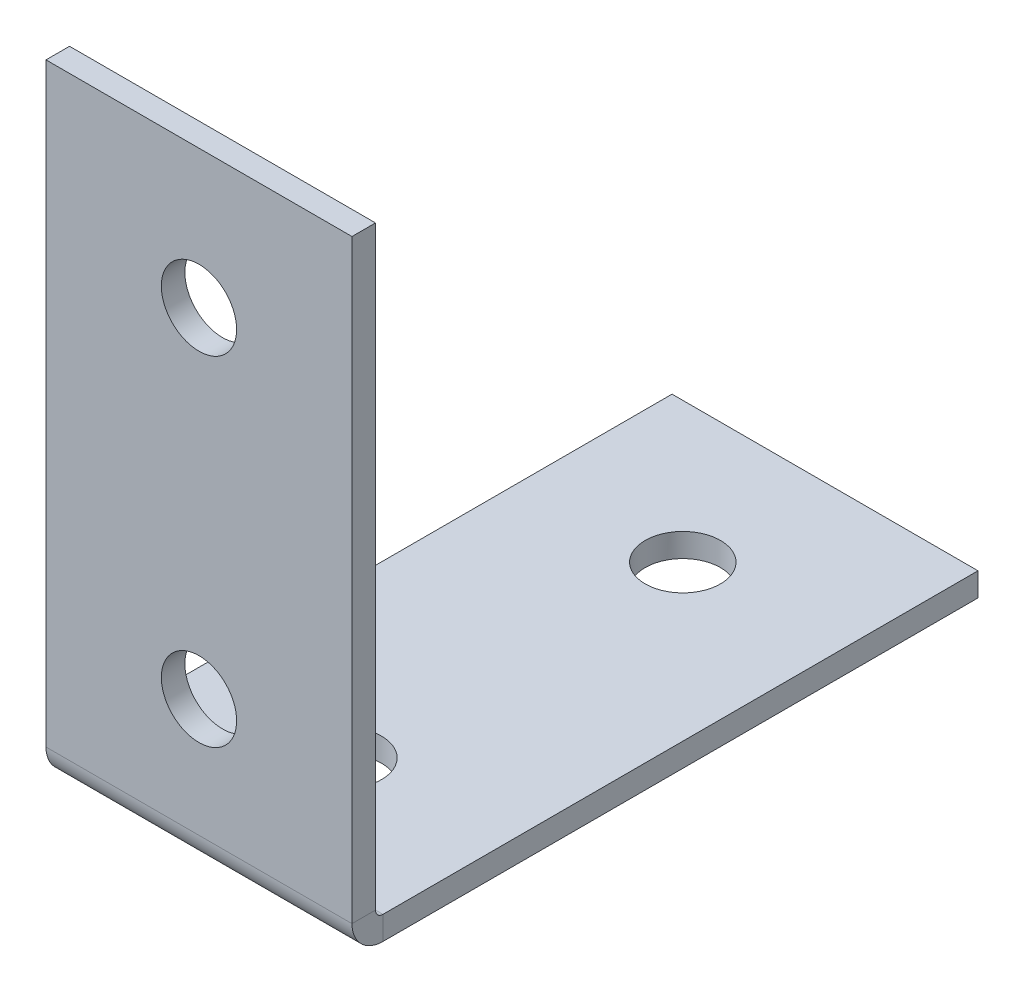
ISO-10303-21;
HEADER;
FILE_DESCRIPTION(('STEP AP214'),'2;1');
FILE_NAME('part.step','',(''),(''),'','','');
FILE_SCHEMA(('AUTOMOTIVE_DESIGN { 1 0 10303 214 1 1 1 1 }'));
ENDSEC;
DATA;
#1=APPLICATION_CONTEXT('core data for automotive mechanical design processes');
#2=APPLICATION_PROTOCOL_DEFINITION('international standard','automotive_design',2000,#1);
#3=PRODUCT_CONTEXT('',#1,'mechanical');
#4=PRODUCT('Part','Part','',(#3));
#5=PRODUCT_RELATED_PRODUCT_CATEGORY('part','',(#4));
#6=PRODUCT_DEFINITION_FORMATION('','',#4);
#7=PRODUCT_DEFINITION_CONTEXT('part definition',#1,'design');
#8=PRODUCT_DEFINITION('design','',#6,#7);
#9=PRODUCT_DEFINITION_SHAPE('','',#8);
#10=(LENGTH_UNIT() NAMED_UNIT(*) SI_UNIT(.MILLI.,.METRE.));
#11=(NAMED_UNIT(*) PLANE_ANGLE_UNIT() SI_UNIT($,.RADIAN.));
#12=(NAMED_UNIT(*) SI_UNIT($,.STERADIAN.) SOLID_ANGLE_UNIT());
#13=UNCERTAINTY_MEASURE_WITH_UNIT(LENGTH_MEASURE(1.E-05),#10,'distance_accuracy_value','');
#14=(GEOMETRIC_REPRESENTATION_CONTEXT(3) GLOBAL_UNCERTAINTY_ASSIGNED_CONTEXT((#13)) GLOBAL_UNIT_ASSIGNED_CONTEXT((#10,
#11,#12)) REPRESENTATION_CONTEXT('',''));
#15=CARTESIAN_POINT('',(0.,0.,0.));
#16=DIRECTION('',(0.,0.,1.));
#17=DIRECTION('',(1.,0.,0.));
#18=AXIS2_PLACEMENT_3D('',#15,#16,#17);
#19=CARTESIAN_POINT('',(41.275,-3.175,0.));
#20=DIRECTION('',(1.,0.,0.));
#21=DIRECTION('',(0.,0.,-1.));
#22=AXIS2_PLACEMENT_3D('',#19,#20,#21);
#23=PLANE('',#22);
#24=DIRECTION('',(0.,0.,-1.));
#25=VECTOR('',#24,1.);
#26=CARTESIAN_POINT('',(41.275,0.,0.));
#27=LINE('',#26,#25);
#28=CARTESIAN_POINT('',(41.275,0.,-0.999999999999998));
#29=VERTEX_POINT('',#28);
#30=CARTESIAN_POINT('',(41.275,0.,-81.28));
#31=VERTEX_POINT('',#30);
#32=EDGE_CURVE('E87',#29,#31,#27,.T.);
#33=ORIENTED_EDGE('',*,*,#32,.F.);
#34=DIRECTION('',(0.,-1.,0.));
#35=VECTOR('',#34,1.);
#36=CARTESIAN_POINT('',(41.275,0.,-0.999999999999998));
#37=LINE('',#36,#35);
#38=CARTESIAN_POINT('',(41.275,-3.175,-0.999999999999998));
#39=VERTEX_POINT('',#38);
#40=EDGE_CURVE('E100',#29,#39,#37,.T.);
#41=ORIENTED_EDGE('',*,*,#40,.T.);
#42=DIRECTION('',(0.,0.,-1.));
#43=VECTOR('',#42,1.);
#44=CARTESIAN_POINT('',(41.275,-3.175,0.));
#45=LINE('',#44,#43);
#46=CARTESIAN_POINT('',(41.275,-3.175,-81.28));
#47=VERTEX_POINT('',#46);
#48=EDGE_CURVE('E94',#39,#47,#45,.T.);
#49=ORIENTED_EDGE('',*,*,#48,.T.);
#50=DIRECTION('',(0.,1.,0.));
#51=VECTOR('',#50,1.);
#52=CARTESIAN_POINT('',(41.275,-3.175,-81.28));
#53=LINE('',#52,#51);
#54=EDGE_CURVE('E43',#47,#31,#53,.T.);
#55=ORIENTED_EDGE('',*,*,#54,.T.);
#56=EDGE_LOOP('',(#33,#41,#49,#55));
#57=FACE_BOUND('',#56,.T.);
#58=ADVANCED_FACE('F39',(#57),#23,.T.);
#59=CARTESIAN_POINT('',(0.,-3.175,0.));
#60=DIRECTION('',(0.,-1.,0.));
#61=DIRECTION('',(0.,0.,-1.));
#62=AXIS2_PLACEMENT_3D('',#59,#60,#61);
#63=PLANE('',#62);
#64=CARTESIAN_POINT('',(20.359792253909,-3.175,-16.6546295695866));
#65=DIRECTION('',(0.,-1.,0.));
#66=DIRECTION('',(0.,0.,-1.));
#67=AXIS2_PLACEMENT_3D('',#64,#65,#66);
#68=CIRCLE('',#67,5.08);
#69=CARTESIAN_POINT('',(20.359792253909,-3.175,-21.7346295695866));
#70=VERTEX_POINT('',#69);
#71=EDGE_CURVE('E174',#70,#70,#68,.F.);
#72=ORIENTED_EDGE('',*,*,#71,.T.);
#73=EDGE_LOOP('',(#72));
#74=FACE_BOUND('',#73,.T.);
#75=CARTESIAN_POINT('',(20.360011306703,-3.175,-62.3746295690619));
#76=DIRECTION('',(0.,-1.,0.));
#77=DIRECTION('',(0.,0.,-1.));
#78=AXIS2_PLACEMENT_3D('',#75,#76,#77);
#79=CIRCLE('',#78,5.08);
#80=CARTESIAN_POINT('',(20.360011306703,-3.175,-67.4546295690619));
#81=VERTEX_POINT('',#80);
#82=EDGE_CURVE('E168',#81,#81,#79,.F.);
#83=ORIENTED_EDGE('',*,*,#82,.T.);
#84=EDGE_LOOP('',(#83));
#85=FACE_BOUND('',#84,.T.);
#86=ORIENTED_EDGE('',*,*,#48,.F.);
#87=DIRECTION('',(1.,0.,0.));
#88=VECTOR('',#87,1.);
#89=CARTESIAN_POINT('',(41.275,-3.175,-0.999999999999998));
#90=LINE('',#89,#88);
#91=CARTESIAN_POINT('',(0.,-3.175,-0.999999999999998));
#92=VERTEX_POINT('',#91);
#93=EDGE_CURVE('E117',#39,#92,#90,.F.);
#94=ORIENTED_EDGE('',*,*,#93,.T.);
#95=DIRECTION('',(0.,0.,1.));
#96=VECTOR('',#95,1.);
#97=CARTESIAN_POINT('',(0.,-3.175,0.));
#98=LINE('',#97,#96);
#99=CARTESIAN_POINT('',(0.,-3.175,-81.28));
#100=VERTEX_POINT('',#99);
#101=EDGE_CURVE('E92',#100,#92,#98,.T.);
#102=ORIENTED_EDGE('',*,*,#101,.F.);
#103=DIRECTION('',(-1.,0.,0.));
#104=VECTOR('',#103,1.);
#105=CARTESIAN_POINT('',(0.,-3.175,-81.28));
#106=LINE('',#105,#104);
#107=EDGE_CURVE('E79',#47,#100,#106,.T.);
#108=ORIENTED_EDGE('',*,*,#107,.F.);
#109=EDGE_LOOP('',(#86,#94,#102,#108));
#110=FACE_BOUND('',#109,.T.);
#111=ADVANCED_FACE('F184',(#74,#85,#110),#63,.T.);
#112=CARTESIAN_POINT('',(0.,0.,0.));
#113=DIRECTION('',(0.,-1.,0.));
#114=DIRECTION('',(0.,0.,-1.));
#115=AXIS2_PLACEMENT_3D('',#112,#113,#114);
#116=PLANE('',#115);
#117=CARTESIAN_POINT('',(20.359792253909,0.,-16.6546295695866));
#118=DIRECTION('',(0.,1.,0.));
#119=DIRECTION('',(0.,0.,1.));
#120=AXIS2_PLACEMENT_3D('',#117,#118,#119);
#121=CIRCLE('',#120,5.08);
#122=CARTESIAN_POINT('',(20.359792253909,0.,-11.5746295695866));
#123=VERTEX_POINT('',#122);
#124=EDGE_CURVE('E163',#123,#123,#121,.T.);
#125=ORIENTED_EDGE('',*,*,#124,.F.);
#126=EDGE_LOOP('',(#125));
#127=FACE_BOUND('',#126,.T.);
#128=CARTESIAN_POINT('',(20.360011306703,0.,-62.3746295690619));
#129=DIRECTION('',(0.,1.,0.));
#130=DIRECTION('',(0.,0.,1.));
#131=AXIS2_PLACEMENT_3D('',#128,#129,#130);
#132=CIRCLE('',#131,5.08);
#133=CARTESIAN_POINT('',(20.360011306703,0.,-57.2946295690619));
#134=VERTEX_POINT('',#133);
#135=EDGE_CURVE('E171',#134,#134,#132,.T.);
#136=ORIENTED_EDGE('',*,*,#135,.F.);
#137=EDGE_LOOP('',(#136));
#138=FACE_BOUND('',#137,.T.);
#139=DIRECTION('',(1.,0.,0.));
#140=VECTOR('',#139,1.);
#141=CARTESIAN_POINT('',(41.275,0.,-0.999999999999998));
#142=LINE('',#141,#140);
#143=CARTESIAN_POINT('',(0.,0.,-0.999999999999998));
#144=VERTEX_POINT('',#143);
#145=EDGE_CURVE('E107',#29,#144,#142,.F.);
#146=ORIENTED_EDGE('',*,*,#145,.F.);
#147=ORIENTED_EDGE('',*,*,#32,.T.);
#148=DIRECTION('',(-1.,0.,0.));
#149=VECTOR('',#148,1.);
#150=CARTESIAN_POINT('',(0.,0.,-81.28));
#151=LINE('',#150,#149);
#152=CARTESIAN_POINT('',(0.,0.,-81.28));
#153=VERTEX_POINT('',#152);
#154=EDGE_CURVE('E77',#31,#153,#151,.T.);
#155=ORIENTED_EDGE('',*,*,#154,.T.);
#156=DIRECTION('',(0.,0.,1.));
#157=VECTOR('',#156,1.);
#158=CARTESIAN_POINT('',(0.,0.,0.));
#159=LINE('',#158,#157);
#160=EDGE_CURVE('E82',#153,#144,#159,.T.);
#161=ORIENTED_EDGE('',*,*,#160,.T.);
#162=EDGE_LOOP('',(#146,#147,#155,#161));
#163=FACE_BOUND('',#162,.T.);
#164=ADVANCED_FACE('F89',(#127,#138,#163),#116,.F.);
#165=CARTESIAN_POINT('',(0.,-3.175,0.));
#166=DIRECTION('',(-1.,0.,0.));
#167=DIRECTION('',(0.,0.,1.));
#168=AXIS2_PLACEMENT_3D('',#165,#166,#167);
#169=PLANE('',#168);
#170=DIRECTION('',(0.,-1.,0.));
#171=VECTOR('',#170,1.);
#172=CARTESIAN_POINT('',(0.,0.,-0.999999999999998));
#173=LINE('',#172,#171);
#174=EDGE_CURVE('E84',#144,#92,#173,.T.);
#175=ORIENTED_EDGE('',*,*,#174,.F.);
#176=ORIENTED_EDGE('',*,*,#160,.F.);
#177=DIRECTION('',(0.,1.,0.));
#178=VECTOR('',#177,1.);
#179=CARTESIAN_POINT('',(0.,-3.175,-81.28));
#180=LINE('',#179,#178);
#181=EDGE_CURVE('E11',#100,#153,#180,.T.);
#182=ORIENTED_EDGE('',*,*,#181,.F.);
#183=ORIENTED_EDGE('',*,*,#101,.T.);
#184=EDGE_LOOP('',(#175,#176,#182,#183));
#185=FACE_BOUND('',#184,.T.);
#186=ADVANCED_FACE('F41',(#185),#169,.T.);
#187=CARTESIAN_POINT('',(0.,-3.175,-81.28));
#188=DIRECTION('',(0.,0.,-1.));
#189=DIRECTION('',(-1.,0.,0.));
#190=AXIS2_PLACEMENT_3D('',#187,#188,#189);
#191=PLANE('',#190);
#192=ORIENTED_EDGE('',*,*,#154,.F.);
#193=ORIENTED_EDGE('',*,*,#54,.F.);
#194=ORIENTED_EDGE('',*,*,#107,.T.);
#195=ORIENTED_EDGE('',*,*,#181,.T.);
#196=EDGE_LOOP('',(#192,#193,#194,#195));
#197=FACE_BOUND('',#196,.T.);
#198=ADVANCED_FACE('F74',(#197),#191,.T.);
#199=CARTESIAN_POINT('',(0.,0.999999999999997,-0.999999999999998));
#200=DIRECTION('',(-1.,0.,0.));
#201=DIRECTION('',(0.,0.,1.));
#202=AXIS2_PLACEMENT_3D('',#199,#200,#201);
#203=PLANE('',#202);
#204=DIRECTION('',(0.,0.,1.));
#205=VECTOR('',#204,1.);
#206=CARTESIAN_POINT('',(0.,0.999999999999997,0.));
#207=LINE('',#206,#205);
#208=CARTESIAN_POINT('',(0.,0.999999999999997,0.));
#209=VERTEX_POINT('',#208);
#210=CARTESIAN_POINT('',(0.,0.999999999999997,3.175));
#211=VERTEX_POINT('',#210);
#212=EDGE_CURVE('E147',#209,#211,#207,.T.);
#213=ORIENTED_EDGE('',*,*,#212,.F.);
#214=CARTESIAN_POINT('',(0.,0.999999999999997,-0.999999999999998));
#215=DIRECTION('',(1.,0.,0.));
#216=DIRECTION('',(0.,0.,-1.));
#217=AXIS2_PLACEMENT_3D('',#214,#215,#216);
#218=CIRCLE('',#217,0.999999999999998);
#219=EDGE_CURVE('E111',#144,#209,#218,.F.);
#220=ORIENTED_EDGE('',*,*,#219,.F.);
#221=ORIENTED_EDGE('',*,*,#174,.T.);
#222=CARTESIAN_POINT('',(0.,0.999999999999997,-0.999999999999998));
#223=DIRECTION('',(1.,0.,0.));
#224=DIRECTION('',(0.,0.,-1.));
#225=AXIS2_PLACEMENT_3D('',#222,#223,#224);
#226=CIRCLE('',#225,4.175);
#227=EDGE_CURVE('E54',#92,#211,#226,.F.);
#228=ORIENTED_EDGE('',*,*,#227,.T.);
#229=EDGE_LOOP('',(#213,#220,#221,#228));
#230=FACE_BOUND('',#229,.T.);
#231=ADVANCED_FACE('F212',(#230),#203,.T.);
#232=CARTESIAN_POINT('',(41.275,0.999999999999997,-0.999999999999998));
#233=DIRECTION('',(-1.,0.,0.));
#234=DIRECTION('',(0.,0.,1.));
#235=AXIS2_PLACEMENT_3D('',#232,#233,#234);
#236=PLANE('',#235);
#237=CARTESIAN_POINT('',(41.275,0.999999999999997,-0.999999999999998));
#238=DIRECTION('',(1.,0.,0.));
#239=DIRECTION('',(0.,0.,-1.));
#240=AXIS2_PLACEMENT_3D('',#237,#238,#239);
#241=CIRCLE('',#240,0.999999999999998);
#242=CARTESIAN_POINT('',(41.275,0.999999999999997,0.));
#243=VERTEX_POINT('',#242);
#244=EDGE_CURVE('E104',#243,#29,#241,.T.);
#245=ORIENTED_EDGE('',*,*,#244,.F.);
#246=DIRECTION('',(0.,0.,1.));
#247=VECTOR('',#246,1.);
#248=CARTESIAN_POINT('',(41.275,0.999999999999997,0.));
#249=LINE('',#248,#247);
#250=CARTESIAN_POINT('',(41.275,0.999999999999997,3.175));
#251=VERTEX_POINT('',#250);
#252=EDGE_CURVE('E146',#243,#251,#249,.T.);
#253=ORIENTED_EDGE('',*,*,#252,.T.);
#254=CARTESIAN_POINT('',(41.275,0.999999999999997,-0.999999999999998));
#255=DIRECTION('',(1.,0.,0.));
#256=DIRECTION('',(0.,0.,-1.));
#257=AXIS2_PLACEMENT_3D('',#254,#255,#256);
#258=CIRCLE('',#257,4.175);
#259=EDGE_CURVE('E114',#251,#39,#258,.T.);
#260=ORIENTED_EDGE('',*,*,#259,.T.);
#261=ORIENTED_EDGE('',*,*,#40,.F.);
#262=EDGE_LOOP('',(#245,#253,#260,#261));
#263=FACE_BOUND('',#262,.T.);
#264=ADVANCED_FACE('F214',(#263),#236,.F.);
#265=CARTESIAN_POINT('',(41.275,0.999999999999997,-0.999999999999998));
#266=DIRECTION('',(1.,0.,0.));
#267=DIRECTION('',(0.,0.,1.));
#268=AXIS2_PLACEMENT_3D('',#265,#266,#267);
#269=CYLINDRICAL_SURFACE('',#268,4.175);
#270=ORIENTED_EDGE('',*,*,#93,.F.);
#271=ORIENTED_EDGE('',*,*,#259,.F.);
#272=DIRECTION('',(-1.,0.,0.));
#273=VECTOR('',#272,1.);
#274=CARTESIAN_POINT('',(0.,0.999999999999997,3.175));
#275=LINE('',#274,#273);
#276=EDGE_CURVE('E137',#251,#211,#275,.T.);
#277=ORIENTED_EDGE('',*,*,#276,.T.);
#278=ORIENTED_EDGE('',*,*,#227,.F.);
#279=EDGE_LOOP('',(#270,#271,#277,#278));
#280=FACE_BOUND('',#279,.T.);
#281=ADVANCED_FACE('F217',(#280),#269,.T.);
#282=CARTESIAN_POINT('',(41.275,0.999999999999997,-0.999999999999998));
#283=DIRECTION('',(1.,0.,0.));
#284=DIRECTION('',(0.,0.,1.));
#285=AXIS2_PLACEMENT_3D('',#282,#283,#284);
#286=CYLINDRICAL_SURFACE('',#285,0.999999999999998);
#287=ORIENTED_EDGE('',*,*,#145,.T.);
#288=ORIENTED_EDGE('',*,*,#219,.T.);
#289=DIRECTION('',(1.,0.,0.));
#290=VECTOR('',#289,1.);
#291=CARTESIAN_POINT('',(0.,0.999999999999997,0.));
#292=LINE('',#291,#290);
#293=EDGE_CURVE('E150',#209,#243,#292,.T.);
#294=ORIENTED_EDGE('',*,*,#293,.T.);
#295=ORIENTED_EDGE('',*,*,#244,.T.);
#296=EDGE_LOOP('',(#287,#288,#294,#295));
#297=FACE_BOUND('',#296,.T.);
#298=ADVANCED_FACE('F222',(#297),#286,.F.);
#299=CARTESIAN_POINT('',(41.275,81.28,3.175));
#300=DIRECTION('',(-1.,0.,0.));
#301=DIRECTION('',(0.,0.,1.));
#302=AXIS2_PLACEMENT_3D('',#299,#300,#301);
#303=PLANE('',#302);
#304=ORIENTED_EDGE('',*,*,#252,.F.);
#305=DIRECTION('',(0.,1.,0.));
#306=VECTOR('',#305,1.);
#307=CARTESIAN_POINT('',(41.275,81.28,0.));
#308=LINE('',#307,#306);
#309=CARTESIAN_POINT('',(41.275,81.28,0.));
#310=VERTEX_POINT('',#309);
#311=EDGE_CURVE('E134',#243,#310,#308,.T.);
#312=ORIENTED_EDGE('',*,*,#311,.T.);
#313=DIRECTION('',(0.,0.,-1.));
#314=VECTOR('',#313,1.);
#315=CARTESIAN_POINT('',(41.275,81.28,3.175));
#316=LINE('',#315,#314);
#317=CARTESIAN_POINT('',(41.275,81.28,3.175));
#318=VERTEX_POINT('',#317);
#319=EDGE_CURVE('E108',#318,#310,#316,.T.);
#320=ORIENTED_EDGE('',*,*,#319,.F.);
#321=DIRECTION('',(0.,1.,0.));
#322=VECTOR('',#321,1.);
#323=CARTESIAN_POINT('',(41.275,81.28,3.175));
#324=LINE('',#323,#322);
#325=EDGE_CURVE('E130',#251,#318,#324,.T.);
#326=ORIENTED_EDGE('',*,*,#325,.F.);
#327=EDGE_LOOP('',(#304,#312,#320,#326));
#328=FACE_BOUND('',#327,.T.);
#329=ADVANCED_FACE('F225',(#328),#303,.F.);
#330=CARTESIAN_POINT('',(0.,0.,3.175));
#331=DIRECTION('',(1.,0.,0.));
#332=DIRECTION('',(0.,0.,-1.));
#333=AXIS2_PLACEMENT_3D('',#330,#331,#332);
#334=PLANE('',#333);
#335=ORIENTED_EDGE('',*,*,#212,.T.);
#336=DIRECTION('',(0.,-1.,0.));
#337=VECTOR('',#336,1.);
#338=CARTESIAN_POINT('',(0.,0.,3.175));
#339=LINE('',#338,#337);
#340=CARTESIAN_POINT('',(0.,81.28,3.175));
#341=VERTEX_POINT('',#340);
#342=EDGE_CURVE('E126',#341,#211,#339,.T.);
#343=ORIENTED_EDGE('',*,*,#342,.F.);
#344=DIRECTION('',(0.,0.,-1.));
#345=VECTOR('',#344,1.);
#346=CARTESIAN_POINT('',(0.,81.28,3.175));
#347=LINE('',#346,#345);
#348=CARTESIAN_POINT('',(0.,81.28,0.));
#349=VERTEX_POINT('',#348);
#350=EDGE_CURVE('E123',#341,#349,#347,.T.);
#351=ORIENTED_EDGE('',*,*,#350,.T.);
#352=DIRECTION('',(0.,-1.,0.));
#353=VECTOR('',#352,1.);
#354=CARTESIAN_POINT('',(0.,0.,0.));
#355=LINE('',#354,#353);
#356=EDGE_CURVE('E127',#349,#209,#355,.T.);
#357=ORIENTED_EDGE('',*,*,#356,.T.);
#358=EDGE_LOOP('',(#335,#343,#351,#357));
#359=FACE_BOUND('',#358,.T.);
#360=ADVANCED_FACE('F231',(#359),#334,.F.);
#361=CARTESIAN_POINT('',(0.,0.,3.175));
#362=DIRECTION('',(0.,0.,-1.));
#363=DIRECTION('',(-1.,0.,0.));
#364=AXIS2_PLACEMENT_3D('',#361,#362,#363);
#365=PLANE('',#364);
#366=CARTESIAN_POINT('',(20.6375,62.6386753256062,3.175));
#367=DIRECTION('',(0.,0.,-1.));
#368=DIRECTION('',(-1.,0.,0.));
#369=AXIS2_PLACEMENT_3D('',#366,#367,#368);
#370=CIRCLE('',#369,5.08);
#371=CARTESIAN_POINT('',(15.5575,62.6386753256062,3.175));
#372=VERTEX_POINT('',#371);
#373=EDGE_CURVE('E151',#372,#372,#370,.F.);
#374=ORIENTED_EDGE('',*,*,#373,.F.);
#375=EDGE_LOOP('',(#374));
#376=FACE_BOUND('',#375,.T.);
#377=CARTESIAN_POINT('',(20.6375,16.9186753256062,3.175));
#378=DIRECTION('',(0.,0.,-1.));
#379=DIRECTION('',(-1.,0.,0.));
#380=AXIS2_PLACEMENT_3D('',#377,#378,#379);
#381=CIRCLE('',#380,5.08);
#382=CARTESIAN_POINT('',(15.5575,16.9186753256062,3.175));
#383=VERTEX_POINT('',#382);
#384=EDGE_CURVE('E156',#383,#383,#381,.F.);
#385=ORIENTED_EDGE('',*,*,#384,.F.);
#386=EDGE_LOOP('',(#385));
#387=FACE_BOUND('',#386,.T.);
#388=ORIENTED_EDGE('',*,*,#276,.F.);
#389=ORIENTED_EDGE('',*,*,#325,.T.);
#390=DIRECTION('',(-1.,0.,0.));
#391=VECTOR('',#390,1.);
#392=CARTESIAN_POINT('',(0.,81.28,3.175));
#393=LINE('',#392,#391);
#394=EDGE_CURVE('E140',#318,#341,#393,.T.);
#395=ORIENTED_EDGE('',*,*,#394,.T.);
#396=ORIENTED_EDGE('',*,*,#342,.T.);
#397=EDGE_LOOP('',(#388,#389,#395,#396));
#398=FACE_BOUND('',#397,.T.);
#399=ADVANCED_FACE('F240',(#376,#387,#398),#365,.F.);
#400=CARTESIAN_POINT('',(0.,0.,0.));
#401=DIRECTION('',(0.,0.,-1.));
#402=DIRECTION('',(-1.,0.,0.));
#403=AXIS2_PLACEMENT_3D('',#400,#401,#402);
#404=PLANE('',#403);
#405=CARTESIAN_POINT('',(20.6375,62.6386753256062,0.));
#406=DIRECTION('',(0.,0.,-1.));
#407=DIRECTION('',(-1.,0.,0.));
#408=AXIS2_PLACEMENT_3D('',#405,#406,#407);
#409=CIRCLE('',#408,5.08);
#410=CARTESIAN_POINT('',(15.5575,62.6386753256062,0.));
#411=VERTEX_POINT('',#410);
#412=EDGE_CURVE('E159',#411,#411,#409,.T.);
#413=ORIENTED_EDGE('',*,*,#412,.F.);
#414=EDGE_LOOP('',(#413));
#415=FACE_BOUND('',#414,.T.);
#416=CARTESIAN_POINT('',(20.6375,16.9186753256062,0.));
#417=DIRECTION('',(0.,0.,-1.));
#418=DIRECTION('',(-1.,0.,0.));
#419=AXIS2_PLACEMENT_3D('',#416,#417,#418);
#420=CIRCLE('',#419,5.08);
#421=CARTESIAN_POINT('',(15.5575,16.9186753256062,0.));
#422=VERTEX_POINT('',#421);
#423=EDGE_CURVE('E160',#422,#422,#420,.T.);
#424=ORIENTED_EDGE('',*,*,#423,.F.);
#425=EDGE_LOOP('',(#424));
#426=FACE_BOUND('',#425,.T.);
#427=ORIENTED_EDGE('',*,*,#311,.F.);
#428=ORIENTED_EDGE('',*,*,#293,.F.);
#429=ORIENTED_EDGE('',*,*,#356,.F.);
#430=DIRECTION('',(-1.,0.,0.));
#431=VECTOR('',#430,1.);
#432=CARTESIAN_POINT('',(0.,81.28,0.));
#433=LINE('',#432,#431);
#434=EDGE_CURVE('E131',#310,#349,#433,.T.);
#435=ORIENTED_EDGE('',*,*,#434,.F.);
#436=EDGE_LOOP('',(#427,#428,#429,#435));
#437=FACE_BOUND('',#436,.T.);
#438=ADVANCED_FACE('F236',(#415,#426,#437),#404,.T.);
#439=CARTESIAN_POINT('',(0.,81.28,3.175));
#440=DIRECTION('',(0.,-1.,0.));
#441=DIRECTION('',(0.,0.,-1.));
#442=AXIS2_PLACEMENT_3D('',#439,#440,#441);
#443=PLANE('',#442);
#444=ORIENTED_EDGE('',*,*,#434,.T.);
#445=ORIENTED_EDGE('',*,*,#350,.F.);
#446=ORIENTED_EDGE('',*,*,#394,.F.);
#447=ORIENTED_EDGE('',*,*,#319,.T.);
#448=EDGE_LOOP('',(#444,#445,#446,#447));
#449=FACE_BOUND('',#448,.T.);
#450=ADVANCED_FACE('F233',(#449),#443,.F.);
#451=CARTESIAN_POINT('',(20.6375,16.9186753256062,3.176));
#452=DIRECTION('',(0.,0.,-1.));
#453=DIRECTION('',(-1.,0.,0.));
#454=AXIS2_PLACEMENT_3D('',#451,#452,#453);
#455=CYLINDRICAL_SURFACE('',#454,5.08);
#456=ORIENTED_EDGE('',*,*,#423,.T.);
#457=EDGE_LOOP('',(#456));
#458=FACE_BOUND('',#457,.T.);
#459=ORIENTED_EDGE('',*,*,#384,.T.);
#460=EDGE_LOOP('',(#459));
#461=FACE_BOUND('',#460,.T.);
#462=ADVANCED_FACE('F199',(#458,#461),#455,.F.);
#463=CARTESIAN_POINT('',(20.6375,62.6386753256062,3.176));
#464=DIRECTION('',(0.,0.,-1.));
#465=DIRECTION('',(-1.,0.,0.));
#466=AXIS2_PLACEMENT_3D('',#463,#464,#465);
#467=CYLINDRICAL_SURFACE('',#466,5.08);
#468=ORIENTED_EDGE('',*,*,#412,.T.);
#469=EDGE_LOOP('',(#468));
#470=FACE_BOUND('',#469,.T.);
#471=ORIENTED_EDGE('',*,*,#373,.T.);
#472=EDGE_LOOP('',(#471));
#473=FACE_BOUND('',#472,.T.);
#474=ADVANCED_FACE('F190',(#470,#473),#467,.F.);
#475=CARTESIAN_POINT('',(20.360011306703,-3.176,-62.3746295690619));
#476=DIRECTION('',(0.,1.,0.));
#477=DIRECTION('',(0.,0.,1.));
#478=AXIS2_PLACEMENT_3D('',#475,#476,#477);
#479=CYLINDRICAL_SURFACE('',#478,5.08);
#480=ORIENTED_EDGE('',*,*,#82,.F.);
#481=EDGE_LOOP('',(#480));
#482=FACE_BOUND('',#481,.T.);
#483=ORIENTED_EDGE('',*,*,#135,.T.);
#484=EDGE_LOOP('',(#483));
#485=FACE_BOUND('',#484,.T.);
#486=ADVANCED_FACE('F188',(#482,#485),#479,.F.);
#487=CARTESIAN_POINT('',(20.359792253909,-3.176,-16.6546295695866));
#488=DIRECTION('',(0.,1.,0.));
#489=DIRECTION('',(0.,0.,1.));
#490=AXIS2_PLACEMENT_3D('',#487,#488,#489);
#491=CYLINDRICAL_SURFACE('',#490,5.08);
#492=ORIENTED_EDGE('',*,*,#71,.F.);
#493=EDGE_LOOP('',(#492));
#494=FACE_BOUND('',#493,.T.);
#495=ORIENTED_EDGE('',*,*,#124,.T.);
#496=EDGE_LOOP('',(#495));
#497=FACE_BOUND('',#496,.T.);
#498=ADVANCED_FACE('F180',(#494,#497),#491,.F.);
#499=CLOSED_SHELL('',(#58,#111,#164,#186,#198,#231,#264,#281,#298,#329,#360,#399,#438,#450,#462,
#474,#486,#498));
#500=MANIFOLD_SOLID_BREP('B2',#499);
#501=ADVANCED_BREP_SHAPE_REPRESENTATION('',(#18,#500),#14);
#502=SHAPE_DEFINITION_REPRESENTATION(#9,#501);
ENDSEC;
END-ISO-10303-21;
